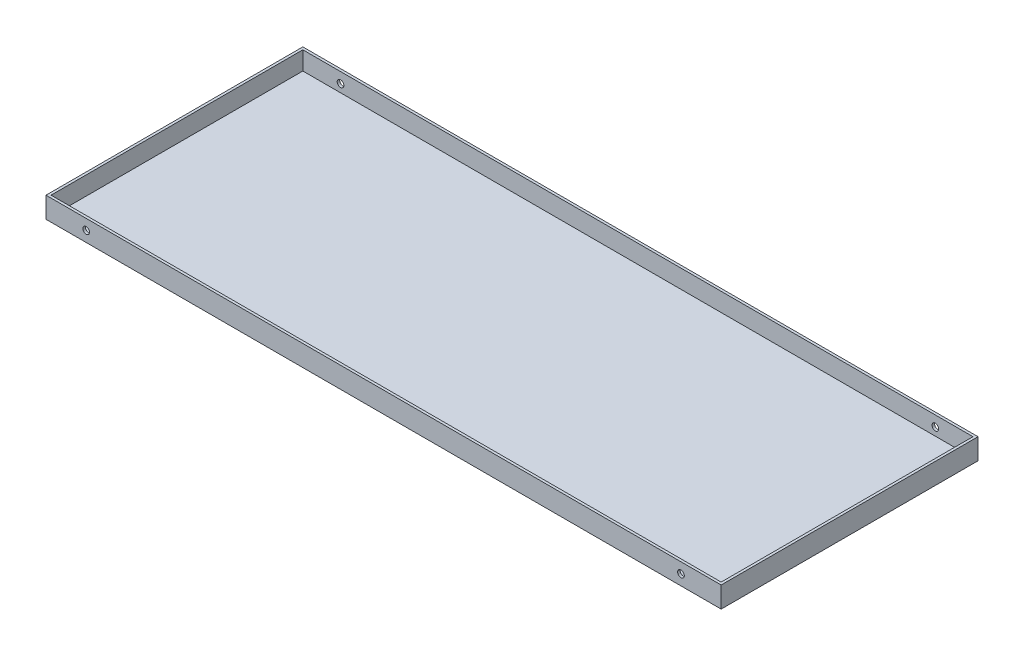
ISO-10303-21;
HEADER;
FILE_DESCRIPTION(('STEP AP214'),'2;1');
FILE_NAME('part.step','',(''),(''),'','','');
FILE_SCHEMA(('AUTOMOTIVE_DESIGN { 1 0 10303 214 1 1 1 1 }'));
ENDSEC;
DATA;
#1=APPLICATION_CONTEXT('core data for automotive mechanical design processes');
#2=APPLICATION_PROTOCOL_DEFINITION('international standard','automotive_design',2000,#1);
#3=PRODUCT_CONTEXT('',#1,'mechanical');
#4=PRODUCT('Part','Part','',(#3));
#5=PRODUCT_RELATED_PRODUCT_CATEGORY('part','',(#4));
#6=PRODUCT_DEFINITION_FORMATION('','',#4);
#7=PRODUCT_DEFINITION_CONTEXT('part definition',#1,'design');
#8=PRODUCT_DEFINITION('design','',#6,#7);
#9=PRODUCT_DEFINITION_SHAPE('','',#8);
#10=(LENGTH_UNIT() NAMED_UNIT(*) SI_UNIT(.MILLI.,.METRE.));
#11=(NAMED_UNIT(*) PLANE_ANGLE_UNIT() SI_UNIT($,.RADIAN.));
#12=(NAMED_UNIT(*) SI_UNIT($,.STERADIAN.) SOLID_ANGLE_UNIT());
#13=UNCERTAINTY_MEASURE_WITH_UNIT(LENGTH_MEASURE(1.E-05),#10,'distance_accuracy_value','');
#14=(GEOMETRIC_REPRESENTATION_CONTEXT(3) GLOBAL_UNCERTAINTY_ASSIGNED_CONTEXT((#13)) GLOBAL_UNIT_ASSIGNED_CONTEXT((#10,
#11,#12)) REPRESENTATION_CONTEXT('',''));
#15=CARTESIAN_POINT('',(0.,0.,0.));
#16=DIRECTION('',(0.,0.,1.));
#17=DIRECTION('',(1.,0.,0.));
#18=AXIS2_PLACEMENT_3D('',#15,#16,#17);
#19=CARTESIAN_POINT('',(807.,25.,0.));
#20=DIRECTION('',(0.,0.,1.));
#21=DIRECTION('',(1.,0.,0.));
#22=AXIS2_PLACEMENT_3D('',#19,#20,#21);
#23=PLANE('',#22);
#24=CARTESIAN_POINT('',(759.,12.5,0.));
#25=DIRECTION('',(0.,0.,1.));
#26=DIRECTION('',(1.,0.,0.));
#27=AXIS2_PLACEMENT_3D('',#24,#25,#26);
#28=CIRCLE('',#27,3.99999999999999);
#29=CARTESIAN_POINT('',(763.,12.5,0.));
#30=VERTEX_POINT('',#29);
#31=EDGE_CURVE('E202',#30,#30,#28,.T.);
#32=ORIENTED_EDGE('',*,*,#31,.T.);
#33=EDGE_LOOP('',(#32));
#34=FACE_BOUND('',#33,.T.);
#35=CARTESIAN_POINT('',(48.,12.5,0.));
#36=DIRECTION('',(0.,0.,1.));
#37=DIRECTION('',(1.,0.,0.));
#38=AXIS2_PLACEMENT_3D('',#35,#36,#37);
#39=CIRCLE('',#38,4.00000000000001);
#40=CARTESIAN_POINT('',(52.,12.5,0.));
#41=VERTEX_POINT('',#40);
#42=EDGE_CURVE('E215',#41,#41,#39,.T.);
#43=ORIENTED_EDGE('',*,*,#42,.T.);
#44=EDGE_LOOP('',(#43));
#45=FACE_BOUND('',#44,.T.);
#46=DIRECTION('',(-1.,0.,0.));
#47=VECTOR('',#46,1.);
#48=CARTESIAN_POINT('',(807.,0.,0.));
#49=LINE('',#48,#47);
#50=CARTESIAN_POINT('',(807.,0.,0.));
#51=VERTEX_POINT('',#50);
#52=CARTESIAN_POINT('',(0.,0.,0.));
#53=VERTEX_POINT('',#52);
#54=EDGE_CURVE('E163',#51,#53,#49,.T.);
#55=ORIENTED_EDGE('',*,*,#54,.T.);
#56=DIRECTION('',(0.,-1.,0.));
#57=VECTOR('',#56,1.);
#58=CARTESIAN_POINT('',(0.,25.,0.));
#59=LINE('',#58,#57);
#60=CARTESIAN_POINT('',(0.,25.,0.));
#61=VERTEX_POINT('',#60);
#62=EDGE_CURVE('E11',#61,#53,#59,.T.);
#63=ORIENTED_EDGE('',*,*,#62,.F.);
#64=DIRECTION('',(-1.,0.,0.));
#65=VECTOR('',#64,1.);
#66=CARTESIAN_POINT('',(807.,25.,0.));
#67=LINE('',#66,#65);
#68=CARTESIAN_POINT('',(807.,25.,0.));
#69=VERTEX_POINT('',#68);
#70=EDGE_CURVE('E169',#69,#61,#67,.T.);
#71=ORIENTED_EDGE('',*,*,#70,.F.);
#72=DIRECTION('',(0.,-1.,0.));
#73=VECTOR('',#72,1.);
#74=CARTESIAN_POINT('',(807.,25.,0.));
#75=LINE('',#74,#73);
#76=EDGE_CURVE('E179',#69,#51,#75,.T.);
#77=ORIENTED_EDGE('',*,*,#76,.T.);
#78=EDGE_LOOP('',(#55,#63,#71,#77));
#79=FACE_BOUND('',#78,.T.);
#80=ADVANCED_FACE('F39',(#34,#45,#79),#23,.F.);
#81=CARTESIAN_POINT('',(0.,25.,0.));
#82=DIRECTION('',(1.,0.,0.));
#83=DIRECTION('',(0.,0.,-1.));
#84=AXIS2_PLACEMENT_3D('',#81,#82,#83);
#85=PLANE('',#84);
#86=DIRECTION('',(0.,0.,1.));
#87=VECTOR('',#86,1.);
#88=CARTESIAN_POINT('',(0.,0.,0.));
#89=LINE('',#88,#87);
#90=CARTESIAN_POINT('',(0.,0.,307.));
#91=VERTEX_POINT('',#90);
#92=EDGE_CURVE('E183',#53,#91,#89,.T.);
#93=ORIENTED_EDGE('',*,*,#92,.T.);
#94=DIRECTION('',(0.,-1.,0.));
#95=VECTOR('',#94,1.);
#96=CARTESIAN_POINT('',(0.,25.,307.));
#97=LINE('',#96,#95);
#98=CARTESIAN_POINT('',(0.,25.,307.));
#99=VERTEX_POINT('',#98);
#100=EDGE_CURVE('E48',#99,#91,#97,.T.);
#101=ORIENTED_EDGE('',*,*,#100,.F.);
#102=DIRECTION('',(0.,0.,1.));
#103=VECTOR('',#102,1.);
#104=CARTESIAN_POINT('',(0.,25.,0.));
#105=LINE('',#104,#103);
#106=EDGE_CURVE('E93',#61,#99,#105,.T.);
#107=ORIENTED_EDGE('',*,*,#106,.F.);
#108=ORIENTED_EDGE('',*,*,#62,.T.);
#109=EDGE_LOOP('',(#93,#101,#107,#108));
#110=FACE_BOUND('',#109,.T.);
#111=ADVANCED_FACE('F233',(#110),#85,.F.);
#112=CARTESIAN_POINT('',(0.,25.,307.));
#113=DIRECTION('',(0.,0.,-1.));
#114=DIRECTION('',(-1.,0.,0.));
#115=AXIS2_PLACEMENT_3D('',#112,#113,#114);
#116=PLANE('',#115);
#117=CARTESIAN_POINT('',(759.,12.5,307.));
#118=DIRECTION('',(0.,0.,1.));
#119=DIRECTION('',(1.,0.,0.));
#120=AXIS2_PLACEMENT_3D('',#117,#118,#119);
#121=CIRCLE('',#120,3.99999999999999);
#122=CARTESIAN_POINT('',(763.,12.5,307.));
#123=VERTEX_POINT('',#122);
#124=EDGE_CURVE('E209',#123,#123,#121,.T.);
#125=ORIENTED_EDGE('',*,*,#124,.F.);
#126=EDGE_LOOP('',(#125));
#127=FACE_BOUND('',#126,.T.);
#128=CARTESIAN_POINT('',(48.,12.5,307.));
#129=DIRECTION('',(0.,0.,1.));
#130=DIRECTION('',(1.,0.,0.));
#131=AXIS2_PLACEMENT_3D('',#128,#129,#130);
#132=CIRCLE('',#131,4.00000000000001);
#133=CARTESIAN_POINT('',(52.,12.5,307.));
#134=VERTEX_POINT('',#133);
#135=EDGE_CURVE('E221',#134,#134,#132,.T.);
#136=ORIENTED_EDGE('',*,*,#135,.F.);
#137=EDGE_LOOP('',(#136));
#138=FACE_BOUND('',#137,.T.);
#139=DIRECTION('',(1.,0.,0.));
#140=VECTOR('',#139,1.);
#141=CARTESIAN_POINT('',(0.,0.,307.));
#142=LINE('',#141,#140);
#143=CARTESIAN_POINT('',(807.,0.,307.));
#144=VERTEX_POINT('',#143);
#145=EDGE_CURVE('E186',#91,#144,#142,.T.);
#146=ORIENTED_EDGE('',*,*,#145,.T.);
#147=DIRECTION('',(0.,-1.,0.));
#148=VECTOR('',#147,1.);
#149=CARTESIAN_POINT('',(807.,25.,307.));
#150=LINE('',#149,#148);
#151=CARTESIAN_POINT('',(807.,25.,307.));
#152=VERTEX_POINT('',#151);
#153=EDGE_CURVE('E193',#152,#144,#150,.T.);
#154=ORIENTED_EDGE('',*,*,#153,.F.);
#155=DIRECTION('',(1.,0.,0.));
#156=VECTOR('',#155,1.);
#157=CARTESIAN_POINT('',(0.,25.,307.));
#158=LINE('',#157,#156);
#159=EDGE_CURVE('E174',#99,#152,#158,.T.);
#160=ORIENTED_EDGE('',*,*,#159,.F.);
#161=ORIENTED_EDGE('',*,*,#100,.T.);
#162=EDGE_LOOP('',(#146,#154,#160,#161));
#163=FACE_BOUND('',#162,.T.);
#164=ADVANCED_FACE('F229',(#127,#138,#163),#116,.F.);
#165=CARTESIAN_POINT('',(807.,25.,307.));
#166=DIRECTION('',(-1.,0.,0.));
#167=DIRECTION('',(0.,0.,1.));
#168=AXIS2_PLACEMENT_3D('',#165,#166,#167);
#169=PLANE('',#168);
#170=DIRECTION('',(0.,0.,-1.));
#171=VECTOR('',#170,1.);
#172=CARTESIAN_POINT('',(807.,0.,307.));
#173=LINE('',#172,#171);
#174=EDGE_CURVE('E86',#144,#51,#173,.T.);
#175=ORIENTED_EDGE('',*,*,#174,.T.);
#176=ORIENTED_EDGE('',*,*,#76,.F.);
#177=DIRECTION('',(0.,0.,-1.));
#178=VECTOR('',#177,1.);
#179=CARTESIAN_POINT('',(807.,25.,307.));
#180=LINE('',#179,#178);
#181=EDGE_CURVE('E65',#152,#69,#180,.T.);
#182=ORIENTED_EDGE('',*,*,#181,.F.);
#183=ORIENTED_EDGE('',*,*,#153,.T.);
#184=EDGE_LOOP('',(#175,#176,#182,#183));
#185=FACE_BOUND('',#184,.T.);
#186=ADVANCED_FACE('F232',(#185),#169,.F.);
#187=CARTESIAN_POINT('',(0.,25.,0.));
#188=DIRECTION('',(0.,1.,0.));
#189=DIRECTION('',(0.,0.,1.));
#190=AXIS2_PLACEMENT_3D('',#187,#188,#189);
#191=PLANE('',#190);
#192=DIRECTION('',(1.,0.,0.));
#193=VECTOR('',#192,1.);
#194=CARTESIAN_POINT('',(3.00000000000004,25.,304.));
#195=LINE('',#194,#193);
#196=CARTESIAN_POINT('',(3.00000000000004,25.,304.));
#197=VERTEX_POINT('',#196);
#198=CARTESIAN_POINT('',(804.,25.,304.));
#199=VERTEX_POINT('',#198);
#200=EDGE_CURVE('E56',#197,#199,#195,.T.);
#201=ORIENTED_EDGE('',*,*,#200,.F.);
#202=DIRECTION('',(0.,0.,1.));
#203=VECTOR('',#202,1.);
#204=CARTESIAN_POINT('',(3.,25.,3.));
#205=LINE('',#204,#203);
#206=CARTESIAN_POINT('',(3.,25.,3.));
#207=VERTEX_POINT('',#206);
#208=EDGE_CURVE('E138',#207,#197,#205,.T.);
#209=ORIENTED_EDGE('',*,*,#208,.F.);
#210=DIRECTION('',(-1.,0.,0.));
#211=VECTOR('',#210,1.);
#212=CARTESIAN_POINT('',(804.,25.,3.));
#213=LINE('',#212,#211);
#214=CARTESIAN_POINT('',(804.,25.,3.));
#215=VERTEX_POINT('',#214);
#216=EDGE_CURVE('E142',#215,#207,#213,.T.);
#217=ORIENTED_EDGE('',*,*,#216,.F.);
#218=DIRECTION('',(0.,0.,-1.));
#219=VECTOR('',#218,1.);
#220=CARTESIAN_POINT('',(804.,25.,304.));
#221=LINE('',#220,#219);
#222=EDGE_CURVE('E154',#199,#215,#221,.T.);
#223=ORIENTED_EDGE('',*,*,#222,.F.);
#224=EDGE_LOOP('',(#201,#209,#217,#223));
#225=FACE_BOUND('',#224,.T.);
#226=ORIENTED_EDGE('',*,*,#70,.T.);
#227=ORIENTED_EDGE('',*,*,#106,.T.);
#228=ORIENTED_EDGE('',*,*,#159,.T.);
#229=ORIENTED_EDGE('',*,*,#181,.T.);
#230=EDGE_LOOP('',(#226,#227,#228,#229));
#231=FACE_BOUND('',#230,.T.);
#232=ADVANCED_FACE('F245',(#225,#231),#191,.T.);
#233=CARTESIAN_POINT('',(0.,0.,0.));
#234=DIRECTION('',(0.,1.,0.));
#235=DIRECTION('',(0.,0.,1.));
#236=AXIS2_PLACEMENT_3D('',#233,#234,#235);
#237=PLANE('',#236);
#238=ORIENTED_EDGE('',*,*,#54,.F.);
#239=ORIENTED_EDGE('',*,*,#174,.F.);
#240=ORIENTED_EDGE('',*,*,#145,.F.);
#241=ORIENTED_EDGE('',*,*,#92,.F.);
#242=EDGE_LOOP('',(#238,#239,#240,#241));
#243=FACE_BOUND('',#242,.T.);
#244=ADVANCED_FACE('F241',(#243),#237,.F.);
#245=CARTESIAN_POINT('',(3.00000000000004,3.,304.));
#246=DIRECTION('',(0.,0.,1.));
#247=DIRECTION('',(1.,0.,0.));
#248=AXIS2_PLACEMENT_3D('',#245,#246,#247);
#249=PLANE('',#248);
#250=CARTESIAN_POINT('',(759.,12.5,304.));
#251=DIRECTION('',(0.,0.,1.));
#252=DIRECTION('',(1.,0.,0.));
#253=AXIS2_PLACEMENT_3D('',#250,#251,#252);
#254=CIRCLE('',#253,3.99999999999999);
#255=CARTESIAN_POINT('',(763.,12.5,304.));
#256=VERTEX_POINT('',#255);
#257=EDGE_CURVE('E145',#256,#256,#254,.T.);
#258=ORIENTED_EDGE('',*,*,#257,.T.);
#259=EDGE_LOOP('',(#258));
#260=FACE_BOUND('',#259,.T.);
#261=CARTESIAN_POINT('',(48.,12.5,304.));
#262=DIRECTION('',(0.,0.,1.));
#263=DIRECTION('',(1.,0.,0.));
#264=AXIS2_PLACEMENT_3D('',#261,#262,#263);
#265=CIRCLE('',#264,4.00000000000001);
#266=CARTESIAN_POINT('',(52.,12.5,304.));
#267=VERTEX_POINT('',#266);
#268=EDGE_CURVE('E201',#267,#267,#265,.T.);
#269=ORIENTED_EDGE('',*,*,#268,.T.);
#270=EDGE_LOOP('',(#269));
#271=FACE_BOUND('',#270,.T.);
#272=ORIENTED_EDGE('',*,*,#200,.T.);
#273=DIRECTION('',(0.,1.,0.));
#274=VECTOR('',#273,1.);
#275=CARTESIAN_POINT('',(804.,3.,304.));
#276=LINE('',#275,#274);
#277=CARTESIAN_POINT('',(804.,3.,304.));
#278=VERTEX_POINT('',#277);
#279=EDGE_CURVE('E113',#278,#199,#276,.T.);
#280=ORIENTED_EDGE('',*,*,#279,.F.);
#281=DIRECTION('',(1.,0.,0.));
#282=VECTOR('',#281,1.);
#283=CARTESIAN_POINT('',(3.00000000000004,3.,304.));
#284=LINE('',#283,#282);
#285=CARTESIAN_POINT('',(3.00000000000004,3.,304.));
#286=VERTEX_POINT('',#285);
#287=EDGE_CURVE('E117',#286,#278,#284,.T.);
#288=ORIENTED_EDGE('',*,*,#287,.F.);
#289=DIRECTION('',(0.,1.,0.));
#290=VECTOR('',#289,1.);
#291=CARTESIAN_POINT('',(3.00000000000004,3.,304.));
#292=LINE('',#291,#290);
#293=EDGE_CURVE('E160',#286,#197,#292,.T.);
#294=ORIENTED_EDGE('',*,*,#293,.T.);
#295=EDGE_LOOP('',(#272,#280,#288,#294));
#296=FACE_BOUND('',#295,.T.);
#297=ADVANCED_FACE('F115',(#260,#271,#296),#249,.F.);
#298=CARTESIAN_POINT('',(3.,3.,3.));
#299=DIRECTION('',(-1.,0.,0.));
#300=DIRECTION('',(0.,0.,1.));
#301=AXIS2_PLACEMENT_3D('',#298,#299,#300);
#302=PLANE('',#301);
#303=ORIENTED_EDGE('',*,*,#208,.T.);
#304=ORIENTED_EDGE('',*,*,#293,.F.);
#305=DIRECTION('',(0.,0.,1.));
#306=VECTOR('',#305,1.);
#307=CARTESIAN_POINT('',(3.,3.,3.));
#308=LINE('',#307,#306);
#309=CARTESIAN_POINT('',(3.,3.,3.));
#310=VERTEX_POINT('',#309);
#311=EDGE_CURVE('E124',#310,#286,#308,.T.);
#312=ORIENTED_EDGE('',*,*,#311,.F.);
#313=DIRECTION('',(0.,1.,0.));
#314=VECTOR('',#313,1.);
#315=CARTESIAN_POINT('',(3.,3.,3.));
#316=LINE('',#315,#314);
#317=EDGE_CURVE('E164',#310,#207,#316,.T.);
#318=ORIENTED_EDGE('',*,*,#317,.T.);
#319=EDGE_LOOP('',(#303,#304,#312,#318));
#320=FACE_BOUND('',#319,.T.);
#321=ADVANCED_FACE('F260',(#320),#302,.F.);
#322=CARTESIAN_POINT('',(804.,3.,3.));
#323=DIRECTION('',(0.,0.,-1.));
#324=DIRECTION('',(-1.,0.,0.));
#325=AXIS2_PLACEMENT_3D('',#322,#323,#324);
#326=PLANE('',#325);
#327=CARTESIAN_POINT('',(759.,12.5,3.));
#328=DIRECTION('',(0.,0.,-1.));
#329=DIRECTION('',(-1.,0.,0.));
#330=AXIS2_PLACEMENT_3D('',#327,#328,#329);
#331=CIRCLE('',#330,3.99999999999999);
#332=CARTESIAN_POINT('',(755.,12.5,3.));
#333=VERTEX_POINT('',#332);
#334=EDGE_CURVE('E42',#333,#333,#331,.T.);
#335=ORIENTED_EDGE('',*,*,#334,.T.);
#336=EDGE_LOOP('',(#335));
#337=FACE_BOUND('',#336,.T.);
#338=CARTESIAN_POINT('',(48.,12.5,3.));
#339=DIRECTION('',(0.,0.,-1.));
#340=DIRECTION('',(-1.,0.,0.));
#341=AXIS2_PLACEMENT_3D('',#338,#339,#340);
#342=CIRCLE('',#341,4.00000000000001);
#343=CARTESIAN_POINT('',(44.,12.5,3.));
#344=VERTEX_POINT('',#343);
#345=EDGE_CURVE('E198',#344,#344,#342,.T.);
#346=ORIENTED_EDGE('',*,*,#345,.T.);
#347=EDGE_LOOP('',(#346));
#348=FACE_BOUND('',#347,.T.);
#349=ORIENTED_EDGE('',*,*,#216,.T.);
#350=ORIENTED_EDGE('',*,*,#317,.F.);
#351=DIRECTION('',(-1.,0.,0.));
#352=VECTOR('',#351,1.);
#353=CARTESIAN_POINT('',(804.,3.,3.));
#354=LINE('',#353,#352);
#355=CARTESIAN_POINT('',(804.,3.,3.));
#356=VERTEX_POINT('',#355);
#357=EDGE_CURVE('E133',#356,#310,#354,.T.);
#358=ORIENTED_EDGE('',*,*,#357,.F.);
#359=DIRECTION('',(0.,1.,0.));
#360=VECTOR('',#359,1.);
#361=CARTESIAN_POINT('',(804.,3.,3.));
#362=LINE('',#361,#360);
#363=EDGE_CURVE('E123',#356,#215,#362,.T.);
#364=ORIENTED_EDGE('',*,*,#363,.T.);
#365=EDGE_LOOP('',(#349,#350,#358,#364));
#366=FACE_BOUND('',#365,.T.);
#367=ADVANCED_FACE('F264',(#337,#348,#366),#326,.F.);
#368=CARTESIAN_POINT('',(804.,3.,304.));
#369=DIRECTION('',(1.,0.,0.));
#370=DIRECTION('',(0.,0.,-1.));
#371=AXIS2_PLACEMENT_3D('',#368,#369,#370);
#372=PLANE('',#371);
#373=ORIENTED_EDGE('',*,*,#222,.T.);
#374=ORIENTED_EDGE('',*,*,#363,.F.);
#375=DIRECTION('',(0.,0.,-1.));
#376=VECTOR('',#375,1.);
#377=CARTESIAN_POINT('',(804.,3.,304.));
#378=LINE('',#377,#376);
#379=EDGE_CURVE('E127',#278,#356,#378,.T.);
#380=ORIENTED_EDGE('',*,*,#379,.F.);
#381=ORIENTED_EDGE('',*,*,#279,.T.);
#382=EDGE_LOOP('',(#373,#374,#380,#381));
#383=FACE_BOUND('',#382,.T.);
#384=ADVANCED_FACE('F128',(#383),#372,.F.);
#385=CARTESIAN_POINT('',(0.,3.,0.));
#386=DIRECTION('',(0.,1.,0.));
#387=DIRECTION('',(0.,0.,1.));
#388=AXIS2_PLACEMENT_3D('',#385,#386,#387);
#389=PLANE('',#388);
#390=ORIENTED_EDGE('',*,*,#287,.T.);
#391=ORIENTED_EDGE('',*,*,#379,.T.);
#392=ORIENTED_EDGE('',*,*,#357,.T.);
#393=ORIENTED_EDGE('',*,*,#311,.T.);
#394=EDGE_LOOP('',(#390,#391,#392,#393));
#395=FACE_BOUND('',#394,.T.);
#396=ADVANCED_FACE('F135',(#395),#389,.T.);
#397=CARTESIAN_POINT('',(48.,12.5,0.));
#398=DIRECTION('',(0.,0.,1.));
#399=DIRECTION('',(1.,0.,0.));
#400=AXIS2_PLACEMENT_3D('',#397,#398,#399);
#401=CYLINDRICAL_SURFACE('',#400,4.00000000000001);
#402=ORIENTED_EDGE('',*,*,#42,.F.);
#403=EDGE_LOOP('',(#402));
#404=FACE_BOUND('',#403,.T.);
#405=ORIENTED_EDGE('',*,*,#345,.F.);
#406=EDGE_LOOP('',(#405));
#407=FACE_BOUND('',#406,.T.);
#408=ADVANCED_FACE('F273',(#404,#407),#401,.F.);
#409=CARTESIAN_POINT('',(759.,12.5,0.));
#410=DIRECTION('',(0.,0.,1.));
#411=DIRECTION('',(1.,0.,0.));
#412=AXIS2_PLACEMENT_3D('',#409,#410,#411);
#413=CYLINDRICAL_SURFACE('',#412,3.99999999999999);
#414=ORIENTED_EDGE('',*,*,#31,.F.);
#415=EDGE_LOOP('',(#414));
#416=FACE_BOUND('',#415,.T.);
#417=ORIENTED_EDGE('',*,*,#334,.F.);
#418=EDGE_LOOP('',(#417));
#419=FACE_BOUND('',#418,.T.);
#420=ADVANCED_FACE('F277',(#416,#419),#413,.F.);
#421=ORIENTED_EDGE('',*,*,#135,.T.);
#422=EDGE_LOOP('',(#421));
#423=FACE_BOUND('',#422,.T.);
#424=ORIENTED_EDGE('',*,*,#268,.F.);
#425=EDGE_LOOP('',(#424));
#426=FACE_BOUND('',#425,.T.);
#427=ADVANCED_FACE('F226',(#423,#426),#401,.F.);
#428=ORIENTED_EDGE('',*,*,#124,.T.);
#429=EDGE_LOOP('',(#428));
#430=FACE_BOUND('',#429,.T.);
#431=ORIENTED_EDGE('',*,*,#257,.F.);
#432=EDGE_LOOP('',(#431));
#433=FACE_BOUND('',#432,.T.);
#434=ADVANCED_FACE('F276',(#430,#433),#413,.F.);
#435=CLOSED_SHELL('',(#80,#111,#164,#186,#232,#244,#297,#321,#367,#384,#396,#408,#420,#427,#434));
#436=MANIFOLD_SOLID_BREP('B2',#435);
#437=ADVANCED_BREP_SHAPE_REPRESENTATION('',(#18,#436),#14);
#438=SHAPE_DEFINITION_REPRESENTATION(#9,#437);
ENDSEC;
END-ISO-10303-21;
